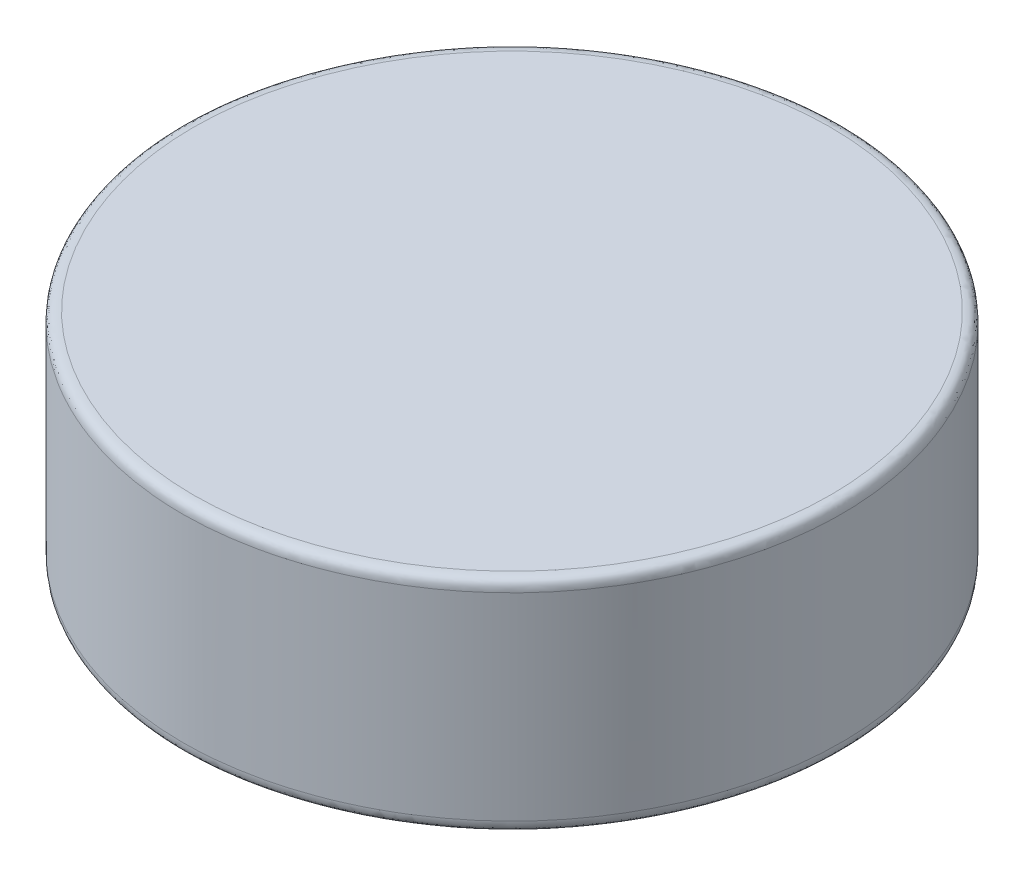
ISO-10303-21;
HEADER;
FILE_DESCRIPTION(('STEP AP214'),'2;1');
FILE_NAME('part.step','',(''),(''),'','','');
FILE_SCHEMA(('AUTOMOTIVE_DESIGN { 1 0 10303 214 1 1 1 1 }'));
ENDSEC;
DATA;
#1=APPLICATION_CONTEXT('core data for automotive mechanical design processes');
#2=APPLICATION_PROTOCOL_DEFINITION('international standard','automotive_design',2000,#1);
#3=PRODUCT_CONTEXT('',#1,'mechanical');
#4=PRODUCT('Part','Part','',(#3));
#5=PRODUCT_RELATED_PRODUCT_CATEGORY('part','',(#4));
#6=PRODUCT_DEFINITION_FORMATION('','',#4);
#7=PRODUCT_DEFINITION_CONTEXT('part definition',#1,'design');
#8=PRODUCT_DEFINITION('design','',#6,#7);
#9=PRODUCT_DEFINITION_SHAPE('','',#8);
#10=(LENGTH_UNIT() NAMED_UNIT(*) SI_UNIT(.MILLI.,.METRE.));
#11=(NAMED_UNIT(*) PLANE_ANGLE_UNIT() SI_UNIT($,.RADIAN.));
#12=(NAMED_UNIT(*) SI_UNIT($,.STERADIAN.) SOLID_ANGLE_UNIT());
#13=UNCERTAINTY_MEASURE_WITH_UNIT(LENGTH_MEASURE(1.E-05),#10,'distance_accuracy_value','');
#14=(GEOMETRIC_REPRESENTATION_CONTEXT(3) GLOBAL_UNCERTAINTY_ASSIGNED_CONTEXT((#13)) GLOBAL_UNIT_ASSIGNED_CONTEXT((#10,
#11,#12)) REPRESENTATION_CONTEXT('',''));
#15=CARTESIAN_POINT('',(0.,0.,0.));
#16=DIRECTION('',(0.,0.,1.));
#17=DIRECTION('',(1.,0.,0.));
#18=AXIS2_PLACEMENT_3D('',#15,#16,#17);
#19=CARTESIAN_POINT('',(0.,2.,0.));
#20=DIRECTION('',(0.,-1.,0.));
#21=DIRECTION('',(0.,0.,-1.));
#22=AXIS2_PLACEMENT_3D('',#19,#20,#21);
#23=CYLINDRICAL_SURFACE('',#22,3.);
#24=CARTESIAN_POINT('',(0.,1.9,3.));
#25=CARTESIAN_POINT('',(0.783611624891226,1.9,3.));
#26=CARTESIAN_POINT('',(2.35083487467367,1.9,2.35083487467367));
#27=CARTESIAN_POINT('',(3.32458256266316,1.9,0.));
#28=CARTESIAN_POINT('',(2.35083487467367,1.9,-2.35083487467368));
#29=CARTESIAN_POINT('',(0.,1.9,-3.32458256266316));
#30=CARTESIAN_POINT('',(-2.35083487467368,1.9,-2.35083487467368));
#31=CARTESIAN_POINT('',(-3.32458256266316,1.9,0.));
#32=CARTESIAN_POINT('',(-2.35083487467368,1.9,2.35083487467366));
#33=CARTESIAN_POINT('',(-0.783611624891226,1.9,3.));
#34=CARTESIAN_POINT('',(0.,1.9,3.));
#35=B_SPLINE_CURVE_WITH_KNOTS('',3,(#24,#25,#26,#27,#28,#29,#30,#31,#32,#33,#34),.UNSPECIFIED.,
.T.,.F.,(4,1,1,1,1,1,1,1,4),(0.,0.785398163397448,1.5707963267949,2.35619449019234,
3.14159265358979,3.92699081698724,4.71238898038469,5.49778714378214,6.28318530717959),.UNSPECIFIED.);
#36=CARTESIAN_POINT('',(0.,1.9,3.));
#37=VERTEX_POINT('',#36);
#38=EDGE_CURVE('E57',#37,#37,#35,.F.);
#39=ORIENTED_EDGE('',*,*,#38,.T.);
#40=EDGE_LOOP('',(#39));
#41=FACE_BOUND('',#40,.T.);
#42=CARTESIAN_POINT('',(0.,0.1,3.));
#43=CARTESIAN_POINT('',(-0.783611624891226,0.1,3.));
#44=CARTESIAN_POINT('',(-2.35083487467368,0.1,2.35083487467366));
#45=CARTESIAN_POINT('',(-3.32458256266316,0.1,0.));
#46=CARTESIAN_POINT('',(-2.35083487467368,0.1,-2.35083487467368));
#47=CARTESIAN_POINT('',(0.,0.1,-3.32458256266316));
#48=CARTESIAN_POINT('',(2.35083487467367,0.1,-2.35083487467368));
#49=CARTESIAN_POINT('',(3.32458256266316,0.1,0.));
#50=CARTESIAN_POINT('',(2.35083487467367,0.1,2.35083487467367));
#51=CARTESIAN_POINT('',(0.783611624891226,0.1,3.));
#52=CARTESIAN_POINT('',(0.,0.1,3.));
#53=B_SPLINE_CURVE_WITH_KNOTS('',3,(#42,#43,#44,#45,#46,#47,#48,#49,#50,#51,#52),.UNSPECIFIED.,
.T.,.F.,(4,1,1,1,1,1,1,1,4),(0.,0.785398163397448,1.5707963267949,2.35619449019235,
3.14159265358979,3.92699081698724,4.71238898038469,5.49778714378214,6.28318530717959),.UNSPECIFIED.);
#54=CARTESIAN_POINT('',(0.,0.1,3.));
#55=VERTEX_POINT('',#54);
#56=EDGE_CURVE('E63',#55,#55,#53,.F.);
#57=ORIENTED_EDGE('',*,*,#56,.T.);
#58=EDGE_LOOP('',(#57));
#59=FACE_BOUND('',#58,.T.);
#60=ADVANCED_FACE('F43',(#41,#59),#23,.T.);
#61=CARTESIAN_POINT('',(0.,2.,0.));
#62=DIRECTION('',(0.,1.,0.));
#63=DIRECTION('',(0.,0.,1.));
#64=AXIS2_PLACEMENT_3D('',#61,#62,#63);
#65=PLANE('',#64);
#66=CARTESIAN_POINT('',(0.,2.,2.9));
#67=CARTESIAN_POINT('',(-0.757491237394852,2.,2.9));
#68=CARTESIAN_POINT('',(-2.27247371218456,2.,2.27247371218454));
#69=CARTESIAN_POINT('',(-3.21376314390772,2.,0.));
#70=CARTESIAN_POINT('',(-2.27247371218455,2.,-2.27247371218455));
#71=CARTESIAN_POINT('',(0.,2.,-3.21376314390772));
#72=CARTESIAN_POINT('',(2.27247371218455,2.,-2.27247371218455));
#73=CARTESIAN_POINT('',(3.21376314390773,2.,0.));
#74=CARTESIAN_POINT('',(2.27247371218455,2.,2.27247371218455));
#75=CARTESIAN_POINT('',(0.757491237394852,2.,2.9));
#76=CARTESIAN_POINT('',(0.,2.,2.9));
#77=B_SPLINE_CURVE_WITH_KNOTS('',3,(#66,#67,#68,#69,#70,#71,#72,#73,#74,#75,#76),.UNSPECIFIED.,
.T.,.F.,(4,1,1,1,1,1,1,1,4),(0.,0.785398163397448,1.5707963267949,2.35619449019235,
3.14159265358979,3.92699081698724,4.71238898038469,5.49778714378214,6.28318530717959),.UNSPECIFIED.);
#78=CARTESIAN_POINT('',(0.,2.,2.9));
#79=VERTEX_POINT('',#78);
#80=EDGE_CURVE('E69',#79,#79,#77,.F.);
#81=ORIENTED_EDGE('',*,*,#80,.T.);
#82=EDGE_LOOP('',(#81));
#83=FACE_BOUND('',#82,.T.);
#84=ADVANCED_FACE('F78',(#83),#65,.T.);
#85=CARTESIAN_POINT('',(0.,0.,0.));
#86=DIRECTION('',(0.,1.,0.));
#87=DIRECTION('',(0.,0.,1.));
#88=AXIS2_PLACEMENT_3D('',#85,#86,#87);
#89=PLANE('',#88);
#90=CARTESIAN_POINT('',(0.,0.,2.9));
#91=CARTESIAN_POINT('',(0.757491237394852,0.,2.9));
#92=CARTESIAN_POINT('',(2.27247371218455,0.,2.27247371218455));
#93=CARTESIAN_POINT('',(3.21376314390773,0.,0.));
#94=CARTESIAN_POINT('',(2.27247371218455,0.,-2.27247371218455));
#95=CARTESIAN_POINT('',(0.,0.,-3.21376314390773));
#96=CARTESIAN_POINT('',(-2.27247371218455,0.,-2.27247371218455));
#97=CARTESIAN_POINT('',(-3.21376314390772,0.,0.));
#98=CARTESIAN_POINT('',(-2.27247371218456,0.,2.27247371218454));
#99=CARTESIAN_POINT('',(-0.757491237394852,0.,2.9));
#100=CARTESIAN_POINT('',(0.,0.,2.9));
#101=B_SPLINE_CURVE_WITH_KNOTS('',3,(#90,#91,#92,#93,#94,#95,#96,#97,#98,#99,#100),
.UNSPECIFIED.,.T.,.F.,(4,1,1,1,1,1,1,1,4),(0.,0.785398163397448,1.5707963267949,
2.35619449019234,3.14159265358979,3.92699081698724,4.71238898038469,5.49778714378214,
6.28318530717959),.UNSPECIFIED.);
#102=CARTESIAN_POINT('',(0.,0.,2.9));
#103=VERTEX_POINT('',#102);
#104=EDGE_CURVE('E10',#103,#103,#101,.F.);
#105=ORIENTED_EDGE('',*,*,#104,.T.);
#106=EDGE_LOOP('',(#105));
#107=FACE_BOUND('',#106,.T.);
#108=ADVANCED_FACE('F94',(#107),#89,.F.);
#109=CARTESIAN_POINT('',(0.,2.,2.9));
#110=CARTESIAN_POINT('',(0.757491237394852,2.,2.9));
#111=CARTESIAN_POINT('',(2.27247371218455,2.,2.27247371218455));
#112=CARTESIAN_POINT('',(3.21376314390773,2.,0.));
#113=CARTESIAN_POINT('',(2.27247371218455,2.,-2.27247371218455));
#114=CARTESIAN_POINT('',(0.,2.,-3.21376314390772));
#115=CARTESIAN_POINT('',(-2.27247371218455,2.,-2.27247371218455));
#116=CARTESIAN_POINT('',(-3.21376314390772,2.,0.));
#117=CARTESIAN_POINT('',(-2.27247371218456,2.,2.27247371218454));
#118=CARTESIAN_POINT('',(-0.757491237394852,2.,2.9));
#119=CARTESIAN_POINT('',(0.,2.,2.9));
#120=CARTESIAN_POINT('',(0.,2.,2.9168198051534));
#121=CARTESIAN_POINT('',(0.761884635677054,2.,2.9168198051534));
#122=CARTESIAN_POINT('',(2.28565390703116,2.,2.28565390703116));
#123=CARTESIAN_POINT('',(3.23240275421452,2.,0.));
#124=CARTESIAN_POINT('',(2.28565390703115,2.,-2.28565390703116));
#125=CARTESIAN_POINT('',(0.,2.,-3.23240275421451));
#126=CARTESIAN_POINT('',(-2.28565390703116,2.,-2.28565390703116));
#127=CARTESIAN_POINT('',(-3.23240275421451,2.,0.));
#128=CARTESIAN_POINT('',(-2.28565390703117,2.,2.28565390703114));
#129=CARTESIAN_POINT('',(-0.761884635677054,2.,2.91681980515339));
#130=CARTESIAN_POINT('',(0.,2.,2.9168198051534));
#131=CARTESIAN_POINT('',(0.,2.,2.93363961030679));
#132=CARTESIAN_POINT('',(0.766278033959256,2.,2.93363961030679));
#133=CARTESIAN_POINT('',(2.29883410187776,2.,2.29883410187776));
#134=CARTESIAN_POINT('',(3.2510423645213,2.,0.));
#135=CARTESIAN_POINT('',(2.29883410187776,2.,-2.29883410187777));
#136=CARTESIAN_POINT('',(0.,2.,-3.2510423645213));
#137=CARTESIAN_POINT('',(-2.29883410187777,2.,-2.29883410187776));
#138=CARTESIAN_POINT('',(-3.2510423645213,2.,0.));
#139=CARTESIAN_POINT('',(-2.29883410187777,2.,2.29883410187775));
#140=CARTESIAN_POINT('',(-0.766278033959256,2.,2.93363961030679));
#141=CARTESIAN_POINT('',(0.,2.,2.93363961030679));
#142=CARTESIAN_POINT('',(0.,1.99283080801639,2.97071067811866));
#143=CARTESIAN_POINT('',(0.775961140520759,1.99283080801639,2.97071067811866));
#144=CARTESIAN_POINT('',(2.32788342156227,1.99283080801639,2.32788342156227));
#145=CARTESIAN_POINT('',(3.29212430639685,1.99283080801639,0.));
#146=CARTESIAN_POINT('',(2.32788342156227,1.99283080801639,-2.32788342156227));
#147=CARTESIAN_POINT('',(0.,1.99283080801639,-3.29212430639685));
#148=CARTESIAN_POINT('',(-2.32788342156227,1.99283080801639,-2.32788342156227));
#149=CARTESIAN_POINT('',(-3.29212430639684,1.99283080801639,0.));
#150=CARTESIAN_POINT('',(-2.32788342156228,1.99283080801639,2.32788342156226));
#151=CARTESIAN_POINT('',(-0.775961140520759,1.99283080801639,2.97071067811865));
#152=CARTESIAN_POINT('',(0.,1.99283080801639,2.97071067811866));
#153=CARTESIAN_POINT('',(0.,1.97071067811865,2.99283080801639));
#154=CARTESIAN_POINT('',(0.781739004164749,1.97071067811865,2.99283080801639));
#155=CARTESIAN_POINT('',(2.34521701249424,1.97071067811866,2.34521701249424));
#156=CARTESIAN_POINT('',(3.31663770577747,1.97071067811865,0.));
#157=CARTESIAN_POINT('',(2.34521701249424,1.97071067811865,-2.34521701249425));
#158=CARTESIAN_POINT('',(0.,1.97071067811865,-3.31663770577747));
#159=CARTESIAN_POINT('',(-2.34521701249425,1.97071067811866,-2.34521701249424));
#160=CARTESIAN_POINT('',(-3.31663770577746,1.97071067811865,0.));
#161=CARTESIAN_POINT('',(-2.34521701249425,1.97071067811866,2.34521701249423));
#162=CARTESIAN_POINT('',(-0.781739004164749,1.97071067811865,2.99283080801639));
#163=CARTESIAN_POINT('',(0.,1.97071067811865,2.99283080801639));
#164=CARTESIAN_POINT('',(0.,1.93363961030679,3.));
#165=CARTESIAN_POINT('',(0.783611624891226,1.93363961030679,3.));
#166=CARTESIAN_POINT('',(2.35083487467367,1.93363961030679,2.35083487467367));
#167=CARTESIAN_POINT('',(3.32458256266316,1.93363961030679,0.));
#168=CARTESIAN_POINT('',(2.35083487467367,1.93363961030679,-2.35083487467368));
#169=CARTESIAN_POINT('',(0.,1.93363961030679,-3.32458256266316));
#170=CARTESIAN_POINT('',(-2.35083487467368,1.93363961030679,-2.35083487467368));
#171=CARTESIAN_POINT('',(-3.32458256266316,1.93363961030679,0.));
#172=CARTESIAN_POINT('',(-2.35083487467368,1.93363961030679,2.35083487467366));
#173=CARTESIAN_POINT('',(-0.783611624891226,1.93363961030679,3.));
#174=CARTESIAN_POINT('',(0.,1.93363961030679,3.));
#175=CARTESIAN_POINT('',(0.,1.91681980515339,3.));
#176=CARTESIAN_POINT('',(0.783611624891226,1.91681980515339,3.));
#177=CARTESIAN_POINT('',(2.35083487467367,1.91681980515339,2.35083487467367));
#178=CARTESIAN_POINT('',(3.32458256266316,1.91681980515339,0.));
#179=CARTESIAN_POINT('',(2.35083487467367,1.91681980515339,-2.35083487467368));
#180=CARTESIAN_POINT('',(0.,1.91681980515339,-3.32458256266316));
#181=CARTESIAN_POINT('',(-2.35083487467368,1.9168198051534,-2.35083487467368));
#182=CARTESIAN_POINT('',(-3.32458256266316,1.91681980515339,0.));
#183=CARTESIAN_POINT('',(-2.35083487467368,1.9168198051534,2.35083487467366));
#184=CARTESIAN_POINT('',(-0.783611624891226,1.91681980515339,3.));
#185=CARTESIAN_POINT('',(0.,1.91681980515339,3.));
#186=CARTESIAN_POINT('',(0.,1.9,3.));
#187=CARTESIAN_POINT('',(0.783611624891226,1.9,3.));
#188=CARTESIAN_POINT('',(2.35083487467367,1.9,2.35083487467367));
#189=CARTESIAN_POINT('',(3.32458256266316,1.9,0.));
#190=CARTESIAN_POINT('',(2.35083487467367,1.9,-2.35083487467368));
#191=CARTESIAN_POINT('',(0.,1.9,-3.32458256266316));
#192=CARTESIAN_POINT('',(-2.35083487467368,1.9,-2.35083487467368));
#193=CARTESIAN_POINT('',(-3.32458256266316,1.9,0.));
#194=CARTESIAN_POINT('',(-2.35083487467368,1.9,2.35083487467366));
#195=CARTESIAN_POINT('',(-0.783611624891226,1.9,3.));
#196=CARTESIAN_POINT('',(0.,1.9,3.));
#197=B_SPLINE_SURFACE_WITH_KNOTS('',5,3,((#109,#110,#111,#112,#113,#114,#115,#116,#117,#118,
#119),(#120,#121,#122,#123,#124,#125,#126,#127,#128,#129,#130),(#131,#132,#133,#134,#135,#136,
#137,#138,#139,#140,#141),(#142,#143,#144,#145,#146,#147,#148,#149,#150,#151,#152),(#153,#154,
#155,#156,#157,#158,#159,#160,#161,#162,#163),(#164,#165,#166,#167,#168,#169,#170,#171,#172,
#173,#174),(#175,#176,#177,#178,#179,#180,#181,#182,#183,#184,#185),(#186,#187,#188,#189,#190,
#191,#192,#193,#194,#195,#196)),.UNSPECIFIED.,.F.,.T.,.F.,(6,2,6),(4,1,1,1,1,1,1,1,4),(0.,0.5,
1.),(0.,0.785398163397448,1.5707963267949,2.35619449019234,3.14159265358979,3.92699081698724,
4.71238898038469,5.49778714378214,6.28318530717959),.UNSPECIFIED.);
#198=ORIENTED_EDGE('',*,*,#38,.F.);
#199=EDGE_LOOP('',(#198));
#200=FACE_BOUND('',#199,.T.);
#201=ORIENTED_EDGE('',*,*,#80,.F.);
#202=EDGE_LOOP('',(#201));
#203=FACE_BOUND('',#202,.T.);
#204=ADVANCED_FACE('F98',(#200,#203),#197,.T.);
#205=CARTESIAN_POINT('',(0.,0.1,3.));
#206=CARTESIAN_POINT('',(0.783611624891226,0.1,3.));
#207=CARTESIAN_POINT('',(2.35083487467367,0.1,2.35083487467367));
#208=CARTESIAN_POINT('',(3.32458256266316,0.1,0.));
#209=CARTESIAN_POINT('',(2.35083487467367,0.1,-2.35083487467368));
#210=CARTESIAN_POINT('',(0.,0.1,-3.32458256266316));
#211=CARTESIAN_POINT('',(-2.35083487467368,0.1,-2.35083487467368));
#212=CARTESIAN_POINT('',(-3.32458256266316,0.1,0.));
#213=CARTESIAN_POINT('',(-2.35083487467368,0.1,2.35083487467366));
#214=CARTESIAN_POINT('',(-0.783611624891226,0.1,3.));
#215=CARTESIAN_POINT('',(0.,0.1,3.));
#216=CARTESIAN_POINT('',(0.,0.0831801948466053,3.));
#217=CARTESIAN_POINT('',(0.783611624891226,0.0831801948466053,3.));
#218=CARTESIAN_POINT('',(2.35083487467367,0.0831801948466054,2.35083487467367));
#219=CARTESIAN_POINT('',(3.32458256266316,0.0831801948466053,0.));
#220=CARTESIAN_POINT('',(2.35083487467367,0.0831801948466054,-2.35083487467368));
#221=CARTESIAN_POINT('',(0.,0.0831801948466053,-3.32458256266316));
#222=CARTESIAN_POINT('',(-2.35083487467368,0.0831801948466054,-2.35083487467368));
#223=CARTESIAN_POINT('',(-3.32458256266316,0.0831801948466052,0.));
#224=CARTESIAN_POINT('',(-2.35083487467368,0.0831801948466056,2.35083487467366));
#225=CARTESIAN_POINT('',(-0.783611624891226,0.0831801948466054,3.));
#226=CARTESIAN_POINT('',(0.,0.0831801948466053,3.));
#227=CARTESIAN_POINT('',(0.,0.0663603896932106,3.));
#228=CARTESIAN_POINT('',(0.783611624891226,0.0663603896932105,3.));
#229=CARTESIAN_POINT('',(2.35083487467367,0.0663603896932107,2.35083487467367));
#230=CARTESIAN_POINT('',(3.32458256266316,0.0663603896932106,0.));
#231=CARTESIAN_POINT('',(2.35083487467367,0.0663603896932107,-2.35083487467368));
#232=CARTESIAN_POINT('',(0.,0.0663603896932106,-3.32458256266316));
#233=CARTESIAN_POINT('',(-2.35083487467368,0.0663603896932107,-2.35083487467368));
#234=CARTESIAN_POINT('',(-3.32458256266316,0.0663603896932104,0.));
#235=CARTESIAN_POINT('',(-2.35083487467368,0.0663603896932111,2.35083487467366));
#236=CARTESIAN_POINT('',(-0.783611624891226,0.0663603896932107,3.));
#237=CARTESIAN_POINT('',(0.,0.0663603896932106,3.));
#238=CARTESIAN_POINT('',(0.,0.0292893218813452,2.99283080801639));
#239=CARTESIAN_POINT('',(0.781739004164749,0.0292893218813452,2.99283080801639));
#240=CARTESIAN_POINT('',(2.34521701249424,0.0292893218813457,2.34521701249424));
#241=CARTESIAN_POINT('',(3.31663770577747,0.0292893218813449,0.));
#242=CARTESIAN_POINT('',(2.34521701249424,0.0292893218813457,-2.34521701249425));
#243=CARTESIAN_POINT('',(0.,0.0292893218813449,-3.31663770577747));
#244=CARTESIAN_POINT('',(-2.34521701249425,0.0292893218813457,-2.34521701249424));
#245=CARTESIAN_POINT('',(-3.31663770577746,0.029289321881345,0.));
#246=CARTESIAN_POINT('',(-2.34521701249425,0.0292893218813455,2.34521701249423));
#247=CARTESIAN_POINT('',(-0.781739004164749,0.0292893218813451,2.99283080801639));
#248=CARTESIAN_POINT('',(0.,0.0292893218813452,2.99283080801639));
#249=CARTESIAN_POINT('',(0.,0.00716919198360802,2.97071067811866));
#250=CARTESIAN_POINT('',(0.775961140520758,0.00716919198360801,2.97071067811866));
#251=CARTESIAN_POINT('',(2.32788342156227,0.00716919198360862,2.32788342156227));
#252=CARTESIAN_POINT('',(3.29212430639685,0.00716919198360772,0.));
#253=CARTESIAN_POINT('',(2.32788342156227,0.00716919198360861,-2.32788342156227));
#254=CARTESIAN_POINT('',(0.,0.00716919198360772,-3.29212430639685));
#255=CARTESIAN_POINT('',(-2.32788342156227,0.00716919198360859,-2.32788342156227));
#256=CARTESIAN_POINT('',(-3.29212430639684,0.00716919198360771,0.));
#257=CARTESIAN_POINT('',(-2.32788342156228,0.00716919198360867,2.32788342156226));
#258=CARTESIAN_POINT('',(-0.775961140520759,0.00716919198360802,2.97071067811865));
#259=CARTESIAN_POINT('',(0.,0.00716919198360802,2.97071067811866));
#260=CARTESIAN_POINT('',(0.,0.,2.93363961030679));
#261=CARTESIAN_POINT('',(0.766278033959256,0.,2.93363961030679));
#262=CARTESIAN_POINT('',(2.29883410187776,0.,2.29883410187776));
#263=CARTESIAN_POINT('',(3.2510423645213,0.,0.));
#264=CARTESIAN_POINT('',(2.29883410187776,0.,-2.29883410187777));
#265=CARTESIAN_POINT('',(0.,0.,-3.2510423645213));
#266=CARTESIAN_POINT('',(-2.29883410187777,0.,-2.29883410187776));
#267=CARTESIAN_POINT('',(-3.2510423645213,0.,0.));
#268=CARTESIAN_POINT('',(-2.29883410187777,0.,2.29883410187775));
#269=CARTESIAN_POINT('',(-0.766278033959256,0.,2.93363961030679));
#270=CARTESIAN_POINT('',(0.,0.,2.93363961030679));
#271=CARTESIAN_POINT('',(0.,0.,2.9168198051534));
#272=CARTESIAN_POINT('',(0.761884635677054,0.,2.9168198051534));
#273=CARTESIAN_POINT('',(2.28565390703116,0.,2.28565390703116));
#274=CARTESIAN_POINT('',(3.23240275421452,0.,0.));
#275=CARTESIAN_POINT('',(2.28565390703115,0.,-2.28565390703116));
#276=CARTESIAN_POINT('',(0.,0.,-3.23240275421451));
#277=CARTESIAN_POINT('',(-2.28565390703116,0.,-2.28565390703116));
#278=CARTESIAN_POINT('',(-3.23240275421451,0.,0.));
#279=CARTESIAN_POINT('',(-2.28565390703117,0.,2.28565390703114));
#280=CARTESIAN_POINT('',(-0.761884635677054,0.,2.91681980515339));
#281=CARTESIAN_POINT('',(0.,0.,2.9168198051534));
#282=CARTESIAN_POINT('',(0.,0.,2.9));
#283=CARTESIAN_POINT('',(0.757491237394852,0.,2.9));
#284=CARTESIAN_POINT('',(2.27247371218455,0.,2.27247371218455));
#285=CARTESIAN_POINT('',(3.21376314390773,0.,0.));
#286=CARTESIAN_POINT('',(2.27247371218455,0.,-2.27247371218455));
#287=CARTESIAN_POINT('',(0.,0.,-3.21376314390772));
#288=CARTESIAN_POINT('',(-2.27247371218455,0.,-2.27247371218455));
#289=CARTESIAN_POINT('',(-3.21376314390772,0.,0.));
#290=CARTESIAN_POINT('',(-2.27247371218456,0.,2.27247371218454));
#291=CARTESIAN_POINT('',(-0.757491237394852,0.,2.9));
#292=CARTESIAN_POINT('',(0.,0.,2.9));
#293=B_SPLINE_SURFACE_WITH_KNOTS('',5,3,((#205,#206,#207,#208,#209,#210,#211,#212,#213,#214,
#215),(#216,#217,#218,#219,#220,#221,#222,#223,#224,#225,#226),(#227,#228,#229,#230,#231,#232,
#233,#234,#235,#236,#237),(#238,#239,#240,#241,#242,#243,#244,#245,#246,#247,#248),(#249,#250,
#251,#252,#253,#254,#255,#256,#257,#258,#259),(#260,#261,#262,#263,#264,#265,#266,#267,#268,
#269,#270),(#271,#272,#273,#274,#275,#276,#277,#278,#279,#280,#281),(#282,#283,#284,#285,#286,
#287,#288,#289,#290,#291,#292)),.UNSPECIFIED.,.F.,.T.,.F.,(6,2,6),(4,1,1,1,1,1,1,1,4),(0.,0.5,
1.),(0.,0.785398163397448,1.5707963267949,2.35619449019234,3.14159265358979,3.92699081698724,
4.71238898038469,5.49778714378214,6.28318530717959),.UNSPECIFIED.);
#294=ORIENTED_EDGE('',*,*,#104,.F.);
#295=EDGE_LOOP('',(#294));
#296=FACE_BOUND('',#295,.T.);
#297=ORIENTED_EDGE('',*,*,#56,.F.);
#298=EDGE_LOOP('',(#297));
#299=FACE_BOUND('',#298,.T.);
#300=ADVANCED_FACE('F46',(#296,#299),#293,.T.);
#301=CLOSED_SHELL('',(#60,#84,#108,#204,#300));
#302=MANIFOLD_SOLID_BREP('B2',#301);
#303=ADVANCED_BREP_SHAPE_REPRESENTATION('',(#18,#302),#14);
#304=SHAPE_DEFINITION_REPRESENTATION(#9,#303);
ENDSEC;
END-ISO-10303-21;
